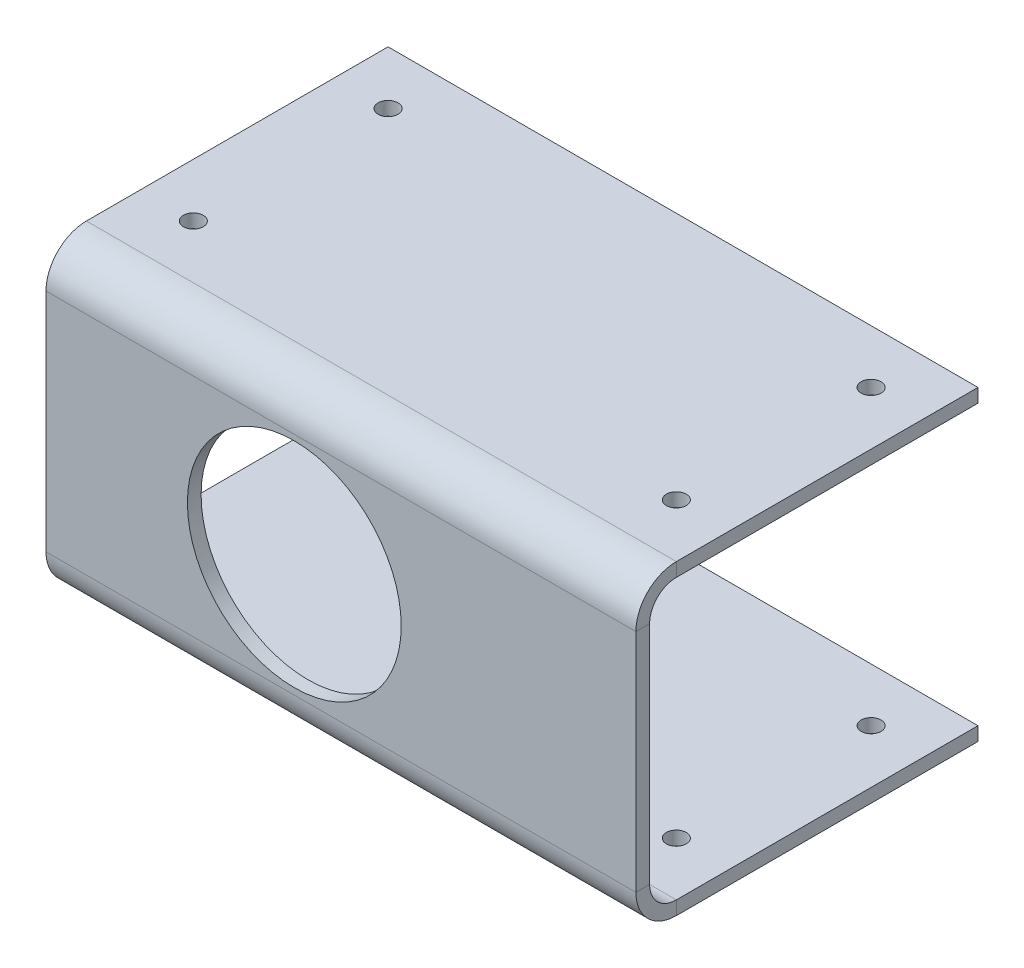
ISO-10303-21;
HEADER;
FILE_DESCRIPTION(('STEP AP214'),'2;1');
FILE_NAME('part.step','',(''),(''),'','','');
FILE_SCHEMA(('AUTOMOTIVE_DESIGN { 1 0 10303 214 1 1 1 1 }'));
ENDSEC;
DATA;
#1=APPLICATION_CONTEXT('core data for automotive mechanical design processes');
#2=APPLICATION_PROTOCOL_DEFINITION('international standard','automotive_design',2000,#1);
#3=PRODUCT_CONTEXT('',#1,'mechanical');
#4=PRODUCT('Part','Part','',(#3));
#5=PRODUCT_RELATED_PRODUCT_CATEGORY('part','',(#4));
#6=PRODUCT_DEFINITION_FORMATION('','',#4);
#7=PRODUCT_DEFINITION_CONTEXT('part definition',#1,'design');
#8=PRODUCT_DEFINITION('design','',#6,#7);
#9=PRODUCT_DEFINITION_SHAPE('','',#8);
#10=(LENGTH_UNIT() NAMED_UNIT(*) SI_UNIT(.MILLI.,.METRE.));
#11=(NAMED_UNIT(*) PLANE_ANGLE_UNIT() SI_UNIT($,.RADIAN.));
#12=(NAMED_UNIT(*) SI_UNIT($,.STERADIAN.) SOLID_ANGLE_UNIT());
#13=UNCERTAINTY_MEASURE_WITH_UNIT(LENGTH_MEASURE(1.E-05),#10,'distance_accuracy_value','');
#14=(GEOMETRIC_REPRESENTATION_CONTEXT(3) GLOBAL_UNCERTAINTY_ASSIGNED_CONTEXT((#13)) GLOBAL_UNIT_ASSIGNED_CONTEXT((#10,
#11,#12)) REPRESENTATION_CONTEXT('',''));
#15=CARTESIAN_POINT('',(0.,0.,0.));
#16=DIRECTION('',(0.,0.,1.));
#17=DIRECTION('',(1.,0.,0.));
#18=AXIS2_PLACEMENT_3D('',#15,#16,#17);
#19=CARTESIAN_POINT('',(-12.6221458224966,8.32,0.8128));
#20=DIRECTION('',(1.,0.,0.));
#21=DIRECTION('',(0.,1.,0.));
#22=AXIS2_PLACEMENT_3D('',#19,#20,#21);
#23=PLANE('',#22);
#24=DIRECTION('',(0.,0.,1.));
#25=VECTOR('',#24,1.);
#26=CARTESIAN_POINT('',(-12.6221458224966,6.7325,0.));
#27=LINE('',#26,#25);
#28=CARTESIAN_POINT('',(-12.6221458224966,6.7325,0.));
#29=VERTEX_POINT('',#28);
#30=CARTESIAN_POINT('',(-12.6221458224966,6.7325,0.8128));
#31=VERTEX_POINT('',#30);
#32=EDGE_CURVE('E183',#29,#31,#27,.T.);
#33=ORIENTED_EDGE('',*,*,#32,.F.);
#34=DIRECTION('',(0.,-1.,0.));
#35=VECTOR('',#34,1.);
#36=CARTESIAN_POINT('',(-12.6221458224966,8.32,0.));
#37=LINE('',#36,#35);
#38=CARTESIAN_POINT('',(-12.6221458224966,-6.68250000000001,0.));
#39=VERTEX_POINT('',#38);
#40=EDGE_CURVE('E234',#29,#39,#37,.T.);
#41=ORIENTED_EDGE('',*,*,#40,.T.);
#42=DIRECTION('',(0.,0.,1.));
#43=VECTOR('',#42,1.);
#44=CARTESIAN_POINT('',(-12.6221458224966,-6.68250000000001,0.));
#45=LINE('',#44,#43);
#46=CARTESIAN_POINT('',(-12.6221458224966,-6.68250000000001,0.8128));
#47=VERTEX_POINT('',#46);
#48=EDGE_CURVE('E222',#39,#47,#45,.T.);
#49=ORIENTED_EDGE('',*,*,#48,.T.);
#50=DIRECTION('',(0.,-1.,0.));
#51=VECTOR('',#50,1.);
#52=CARTESIAN_POINT('',(-12.6221458224966,8.32,0.8128));
#53=LINE('',#52,#51);
#54=EDGE_CURVE('E44',#31,#47,#53,.T.);
#55=ORIENTED_EDGE('',*,*,#54,.F.);
#56=EDGE_LOOP('',(#33,#41,#49,#55));
#57=FACE_BOUND('',#56,.T.);
#58=ADVANCED_FACE('F36',(#57),#23,.F.);
#59=CARTESIAN_POINT('',(22.42,-8.27,0.8128));
#60=DIRECTION('',(-1.,0.,0.));
#61=DIRECTION('',(0.,0.,1.));
#62=AXIS2_PLACEMENT_3D('',#59,#60,#61);
#63=PLANE('',#62);
#64=DIRECTION('',(0.,0.,1.));
#65=VECTOR('',#64,1.);
#66=CARTESIAN_POINT('',(22.42,6.7325,0.));
#67=LINE('',#66,#65);
#68=CARTESIAN_POINT('',(22.42,6.7325,0.));
#69=VERTEX_POINT('',#68);
#70=CARTESIAN_POINT('',(22.42,6.7325,0.812800000000002));
#71=VERTEX_POINT('',#70);
#72=EDGE_CURVE('E176',#69,#71,#67,.T.);
#73=ORIENTED_EDGE('',*,*,#72,.T.);
#74=DIRECTION('',(0.,1.,0.));
#75=VECTOR('',#74,1.);
#76=CARTESIAN_POINT('',(22.42,-8.27,0.8128));
#77=LINE('',#76,#75);
#78=CARTESIAN_POINT('',(22.42,-6.68250000000001,0.8128));
#79=VERTEX_POINT('',#78);
#80=EDGE_CURVE('E11',#79,#71,#77,.T.);
#81=ORIENTED_EDGE('',*,*,#80,.F.);
#82=DIRECTION('',(0.,0.,1.));
#83=VECTOR('',#82,1.);
#84=CARTESIAN_POINT('',(22.42,-6.68250000000001,0.));
#85=LINE('',#84,#83);
#86=CARTESIAN_POINT('',(22.42,-6.68250000000001,0.));
#87=VERTEX_POINT('',#86);
#88=EDGE_CURVE('E232',#87,#79,#85,.T.);
#89=ORIENTED_EDGE('',*,*,#88,.F.);
#90=DIRECTION('',(0.,1.,0.));
#91=VECTOR('',#90,1.);
#92=CARTESIAN_POINT('',(22.42,-8.27,0.));
#93=LINE('',#92,#91);
#94=EDGE_CURVE('E238',#87,#69,#93,.T.);
#95=ORIENTED_EDGE('',*,*,#94,.T.);
#96=EDGE_LOOP('',(#73,#81,#89,#95));
#97=FACE_BOUND('',#96,.T.);
#98=ADVANCED_FACE('F325',(#97),#63,.F.);
#99=CARTESIAN_POINT('',(0.,0.,0.8128));
#100=DIRECTION('',(0.,0.,1.));
#101=DIRECTION('',(1.,0.,0.));
#102=AXIS2_PLACEMENT_3D('',#99,#100,#101);
#103=PLANE('',#102);
#104=CARTESIAN_POINT('',(2.12785417750338,0.0499999999999398,0.8128));
#105=DIRECTION('',(0.,0.,1.));
#106=DIRECTION('',(1.,0.,0.));
#107=AXIS2_PLACEMENT_3D('',#104,#105,#106);
#108=CIRCLE('',#107,6.35);
#109=CARTESIAN_POINT('',(8.47785417750338,0.0499999999999398,0.8128));
#110=VERTEX_POINT('',#109);
#111=EDGE_CURVE('E248',#110,#110,#108,.T.);
#112=ORIENTED_EDGE('',*,*,#111,.F.);
#113=EDGE_LOOP('',(#112));
#114=FACE_BOUND('',#113,.T.);
#115=ORIENTED_EDGE('',*,*,#80,.T.);
#116=DIRECTION('',(1.,0.,0.));
#117=VECTOR('',#116,1.);
#118=CARTESIAN_POINT('',(22.42,6.7325,0.812800000000002));
#119=LINE('',#118,#117);
#120=EDGE_CURVE('E130',#71,#31,#119,.F.);
#121=ORIENTED_EDGE('',*,*,#120,.T.);
#122=ORIENTED_EDGE('',*,*,#54,.T.);
#123=DIRECTION('',(-1.,0.,0.));
#124=VECTOR('',#123,1.);
#125=CARTESIAN_POINT('',(-12.6221458224966,-6.68250000000001,0.8128));
#126=LINE('',#125,#124);
#127=EDGE_CURVE('E217',#47,#79,#126,.F.);
#128=ORIENTED_EDGE('',*,*,#127,.T.);
#129=EDGE_LOOP('',(#115,#121,#122,#128));
#130=FACE_BOUND('',#129,.T.);
#131=ADVANCED_FACE('F330',(#114,#130),#103,.T.);
#132=CARTESIAN_POINT('',(0.,0.,0.));
#133=DIRECTION('',(0.,0.,1.));
#134=DIRECTION('',(1.,0.,0.));
#135=AXIS2_PLACEMENT_3D('',#132,#133,#134);
#136=PLANE('',#135);
#137=CARTESIAN_POINT('',(2.12785417750338,0.0499999999999398,0.));
#138=DIRECTION('',(0.,0.,1.));
#139=DIRECTION('',(1.,0.,0.));
#140=AXIS2_PLACEMENT_3D('',#137,#138,#139);
#141=CIRCLE('',#140,6.35);
#142=CARTESIAN_POINT('',(8.47785417750338,0.0499999999999398,0.));
#143=VERTEX_POINT('',#142);
#144=EDGE_CURVE('E244',#143,#143,#141,.T.);
#145=ORIENTED_EDGE('',*,*,#144,.T.);
#146=EDGE_LOOP('',(#145));
#147=FACE_BOUND('',#146,.T.);
#148=DIRECTION('',(1.,0.,0.));
#149=VECTOR('',#148,1.);
#150=CARTESIAN_POINT('',(22.42,6.7325,0.));
#151=LINE('',#150,#149);
#152=EDGE_CURVE('E180',#69,#29,#151,.F.);
#153=ORIENTED_EDGE('',*,*,#152,.F.);
#154=ORIENTED_EDGE('',*,*,#94,.F.);
#155=DIRECTION('',(-1.,0.,0.));
#156=VECTOR('',#155,1.);
#157=CARTESIAN_POINT('',(-12.6221458224966,-6.68250000000001,0.));
#158=LINE('',#157,#156);
#159=EDGE_CURVE('E228',#39,#87,#158,.F.);
#160=ORIENTED_EDGE('',*,*,#159,.F.);
#161=ORIENTED_EDGE('',*,*,#40,.F.);
#162=EDGE_LOOP('',(#153,#154,#160,#161));
#163=FACE_BOUND('',#162,.T.);
#164=ADVANCED_FACE('F340',(#147,#163),#136,.F.);
#165=CARTESIAN_POINT('',(22.42,-6.68250000000001,-1.5875));
#166=DIRECTION('',(1.,0.,0.));
#167=DIRECTION('',(0.,0.,-1.));
#168=AXIS2_PLACEMENT_3D('',#165,#166,#167);
#169=PLANE('',#168);
#170=DIRECTION('',(0.,-1.,0.));
#171=VECTOR('',#170,1.);
#172=CARTESIAN_POINT('',(22.42,-8.27000000000001,-1.58749999999999));
#173=LINE('',#172,#171);
#174=CARTESIAN_POINT('',(22.42,-8.27,-1.58749999999999));
#175=VERTEX_POINT('',#174);
#176=CARTESIAN_POINT('',(22.42,-9.08280000000001,-1.58749999999999));
#177=VERTEX_POINT('',#176);
#178=EDGE_CURVE('E185',#175,#177,#173,.T.);
#179=ORIENTED_EDGE('',*,*,#178,.F.);
#180=CARTESIAN_POINT('',(22.42,-6.68250000000001,-1.5875));
#181=DIRECTION('',(-1.,0.,0.));
#182=DIRECTION('',(0.,0.,1.));
#183=AXIS2_PLACEMENT_3D('',#180,#181,#182);
#184=CIRCLE('',#183,1.5875);
#185=EDGE_CURVE('E225',#87,#175,#184,.F.);
#186=ORIENTED_EDGE('',*,*,#185,.F.);
#187=ORIENTED_EDGE('',*,*,#88,.T.);
#188=CARTESIAN_POINT('',(22.42,-6.68250000000001,-1.5875));
#189=DIRECTION('',(-1.,0.,0.));
#190=DIRECTION('',(0.,0.,1.));
#191=AXIS2_PLACEMENT_3D('',#188,#189,#190);
#192=CIRCLE('',#191,2.4003);
#193=EDGE_CURVE('E60',#79,#177,#192,.F.);
#194=ORIENTED_EDGE('',*,*,#193,.T.);
#195=EDGE_LOOP('',(#179,#186,#187,#194));
#196=FACE_BOUND('',#195,.T.);
#197=ADVANCED_FACE('F347',(#196),#169,.T.);
#198=CARTESIAN_POINT('',(-12.6221458224966,-6.68250000000001,-1.5875));
#199=DIRECTION('',(1.,0.,0.));
#200=DIRECTION('',(0.,0.,-1.));
#201=AXIS2_PLACEMENT_3D('',#198,#199,#200);
#202=PLANE('',#201);
#203=CARTESIAN_POINT('',(-12.6221458224966,-6.68250000000001,-1.5875));
#204=DIRECTION('',(-1.,0.,0.));
#205=DIRECTION('',(0.,0.,1.));
#206=AXIS2_PLACEMENT_3D('',#203,#204,#205);
#207=CIRCLE('',#206,1.5875);
#208=CARTESIAN_POINT('',(-12.6221458224966,-8.27,-1.58749999999999));
#209=VERTEX_POINT('',#208);
#210=EDGE_CURVE('E216',#209,#39,#207,.T.);
#211=ORIENTED_EDGE('',*,*,#210,.F.);
#212=DIRECTION('',(0.,-1.,0.));
#213=VECTOR('',#212,1.);
#214=CARTESIAN_POINT('',(-12.6221458224966,-8.27000000000001,-1.58749999999999));
#215=LINE('',#214,#213);
#216=CARTESIAN_POINT('',(-12.6221458224966,-9.08280000000001,-1.58749999999999));
#217=VERTEX_POINT('',#216);
#218=EDGE_CURVE('E189',#209,#217,#215,.T.);
#219=ORIENTED_EDGE('',*,*,#218,.T.);
#220=CARTESIAN_POINT('',(-12.6221458224966,-6.68250000000001,-1.5875));
#221=DIRECTION('',(-1.,0.,0.));
#222=DIRECTION('',(0.,0.,1.));
#223=AXIS2_PLACEMENT_3D('',#220,#221,#222);
#224=CIRCLE('',#223,2.4003);
#225=EDGE_CURVE('E220',#217,#47,#224,.T.);
#226=ORIENTED_EDGE('',*,*,#225,.T.);
#227=ORIENTED_EDGE('',*,*,#48,.F.);
#228=EDGE_LOOP('',(#211,#219,#226,#227));
#229=FACE_BOUND('',#228,.T.);
#230=ADVANCED_FACE('F367',(#229),#202,.F.);
#231=CARTESIAN_POINT('',(-12.6221458224966,-6.68250000000001,-1.5875));
#232=DIRECTION('',(-1.,0.,0.));
#233=DIRECTION('',(0.,-1.,0.));
#234=AXIS2_PLACEMENT_3D('',#231,#232,#233);
#235=CYLINDRICAL_SURFACE('',#234,2.4003);
#236=ORIENTED_EDGE('',*,*,#127,.F.);
#237=ORIENTED_EDGE('',*,*,#225,.F.);
#238=DIRECTION('',(1.,0.,0.));
#239=VECTOR('',#238,1.);
#240=CARTESIAN_POINT('',(0.,-9.08280000000001,-1.58749999999999));
#241=LINE('',#240,#239);
#242=EDGE_CURVE('E192',#217,#177,#241,.T.);
#243=ORIENTED_EDGE('',*,*,#242,.T.);
#244=ORIENTED_EDGE('',*,*,#193,.F.);
#245=EDGE_LOOP('',(#236,#237,#243,#244));
#246=FACE_BOUND('',#245,.T.);
#247=ADVANCED_FACE('F377',(#246),#235,.T.);
#248=CARTESIAN_POINT('',(-12.6221458224966,-6.68250000000001,-1.5875));
#249=DIRECTION('',(-1.,0.,0.));
#250=DIRECTION('',(0.,-1.,0.));
#251=AXIS2_PLACEMENT_3D('',#248,#249,#250);
#252=CYLINDRICAL_SURFACE('',#251,1.5875);
#253=ORIENTED_EDGE('',*,*,#159,.T.);
#254=ORIENTED_EDGE('',*,*,#185,.T.);
#255=DIRECTION('',(-1.,0.,0.));
#256=VECTOR('',#255,1.);
#257=CARTESIAN_POINT('',(22.42,-8.27000000000001,-1.58749999999999));
#258=LINE('',#257,#256);
#259=EDGE_CURVE('E187',#175,#209,#258,.T.);
#260=ORIENTED_EDGE('',*,*,#259,.T.);
#261=ORIENTED_EDGE('',*,*,#210,.T.);
#262=EDGE_LOOP('',(#253,#254,#260,#261));
#263=FACE_BOUND('',#262,.T.);
#264=ADVANCED_FACE('F343',(#263),#252,.F.);
#265=CARTESIAN_POINT('',(-12.6221458224966,-9.08280000000007,-19.5072));
#266=DIRECTION('',(1.,0.,0.));
#267=DIRECTION('',(0.,0.,-1.));
#268=AXIS2_PLACEMENT_3D('',#265,#266,#267);
#269=PLANE('',#268);
#270=ORIENTED_EDGE('',*,*,#218,.F.);
#271=DIRECTION('',(0.,0.,-1.));
#272=VECTOR('',#271,1.);
#273=CARTESIAN_POINT('',(-12.6221458224966,-8.27000000000007,-19.5072));
#274=LINE('',#273,#272);
#275=CARTESIAN_POINT('',(-12.6221458224966,-8.27000000000007,-19.5072));
#276=VERTEX_POINT('',#275);
#277=EDGE_CURVE('E196',#209,#276,#274,.T.);
#278=ORIENTED_EDGE('',*,*,#277,.T.);
#279=DIRECTION('',(0.,1.,0.));
#280=VECTOR('',#279,1.);
#281=CARTESIAN_POINT('',(-12.6221458224966,-9.08280000000007,-19.5072));
#282=LINE('',#281,#280);
#283=CARTESIAN_POINT('',(-12.6221458224966,-9.08280000000007,-19.5072));
#284=VERTEX_POINT('',#283);
#285=EDGE_CURVE('E213',#284,#276,#282,.T.);
#286=ORIENTED_EDGE('',*,*,#285,.F.);
#287=DIRECTION('',(0.,0.,-1.));
#288=VECTOR('',#287,1.);
#289=CARTESIAN_POINT('',(-12.6221458224966,-9.08280000000007,-19.5072));
#290=LINE('',#289,#288);
#291=EDGE_CURVE('E197',#217,#284,#290,.T.);
#292=ORIENTED_EDGE('',*,*,#291,.F.);
#293=EDGE_LOOP('',(#270,#278,#286,#292));
#294=FACE_BOUND('',#293,.T.);
#295=ADVANCED_FACE('F369',(#294),#269,.F.);
#296=CARTESIAN_POINT('',(22.42,-9.0828,0.));
#297=DIRECTION('',(-1.,0.,0.));
#298=DIRECTION('',(0.,0.,1.));
#299=AXIS2_PLACEMENT_3D('',#296,#297,#298);
#300=PLANE('',#299);
#301=ORIENTED_EDGE('',*,*,#178,.T.);
#302=DIRECTION('',(0.,0.,1.));
#303=VECTOR('',#302,1.);
#304=CARTESIAN_POINT('',(22.42,-9.0828,0.));
#305=LINE('',#304,#303);
#306=CARTESIAN_POINT('',(22.42,-9.08280000000007,-19.5072));
#307=VERTEX_POINT('',#306);
#308=EDGE_CURVE('E202',#307,#177,#305,.T.);
#309=ORIENTED_EDGE('',*,*,#308,.F.);
#310=DIRECTION('',(0.,1.,0.));
#311=VECTOR('',#310,1.);
#312=CARTESIAN_POINT('',(22.42,-9.08280000000007,-19.5072));
#313=LINE('',#312,#311);
#314=CARTESIAN_POINT('',(22.42,-8.27000000000007,-19.5072));
#315=VERTEX_POINT('',#314);
#316=EDGE_CURVE('E205',#307,#315,#313,.T.);
#317=ORIENTED_EDGE('',*,*,#316,.T.);
#318=DIRECTION('',(0.,0.,1.));
#319=VECTOR('',#318,1.);
#320=CARTESIAN_POINT('',(22.42,-8.27,0.));
#321=LINE('',#320,#319);
#322=EDGE_CURVE('E200',#315,#175,#321,.T.);
#323=ORIENTED_EDGE('',*,*,#322,.T.);
#324=EDGE_LOOP('',(#301,#309,#317,#323));
#325=FACE_BOUND('',#324,.T.);
#326=ADVANCED_FACE('F350',(#325),#300,.F.);
#327=CARTESIAN_POINT('',(0.,-9.0828,0.));
#328=DIRECTION('',(0.,1.,0.));
#329=DIRECTION('',(0.,0.,1.));
#330=AXIS2_PLACEMENT_3D('',#327,#328,#329);
#331=PLANE('',#330);
#332=CARTESIAN_POINT('',(19.245,-9.08280000000012,-4.7625000000003));
#333=DIRECTION('',(0.,1.,0.));
#334=DIRECTION('',(0.,0.,1.));
#335=AXIS2_PLACEMENT_3D('',#332,#333,#334);
#336=CIRCLE('',#335,0.590549999999999);
#337=CARTESIAN_POINT('',(19.245,-9.08280000000012,-4.1719500000003));
#338=VERTEX_POINT('',#337);
#339=EDGE_CURVE('E658',#338,#338,#336,.T.);
#340=ORIENTED_EDGE('',*,*,#339,.T.);
#341=EDGE_LOOP('',(#340));
#342=FACE_BOUND('',#341,.T.);
#343=CARTESIAN_POINT('',(19.245,-9.08280000000008,-16.3322000000002));
#344=DIRECTION('',(0.,1.,0.));
#345=DIRECTION('',(0.,0.,1.));
#346=AXIS2_PLACEMENT_3D('',#343,#344,#345);
#347=CIRCLE('',#346,0.590549999999999);
#348=CARTESIAN_POINT('',(19.245,-9.08280000000008,-15.7416500000002));
#349=VERTEX_POINT('',#348);
#350=EDGE_CURVE('E256',#349,#349,#347,.T.);
#351=ORIENTED_EDGE('',*,*,#350,.T.);
#352=EDGE_LOOP('',(#351));
#353=FACE_BOUND('',#352,.T.);
#354=CARTESIAN_POINT('',(-9.44714582249659,-9.08280000000008,-16.3322000000002));
#355=DIRECTION('',(0.,1.,0.));
#356=DIRECTION('',(0.,0.,1.));
#357=AXIS2_PLACEMENT_3D('',#354,#355,#356);
#358=CIRCLE('',#357,0.590549999999997);
#359=CARTESIAN_POINT('',(-9.44714582249659,-9.08280000000008,-15.7416500000002));
#360=VERTEX_POINT('',#359);
#361=EDGE_CURVE('E252',#360,#360,#358,.T.);
#362=ORIENTED_EDGE('',*,*,#361,.T.);
#363=EDGE_LOOP('',(#362));
#364=FACE_BOUND('',#363,.T.);
#365=CARTESIAN_POINT('',(-9.44714582249658,-9.08280000000012,-4.7625000000003));
#366=DIRECTION('',(0.,1.,0.));
#367=DIRECTION('',(0.,0.,1.));
#368=AXIS2_PLACEMENT_3D('',#365,#366,#367);
#369=CIRCLE('',#368,0.590549999999997);
#370=CARTESIAN_POINT('',(-9.44714582249658,-9.08280000000012,-4.1719500000003));
#371=VERTEX_POINT('',#370);
#372=EDGE_CURVE('E281',#371,#371,#369,.T.);
#373=ORIENTED_EDGE('',*,*,#372,.T.);
#374=EDGE_LOOP('',(#373));
#375=FACE_BOUND('',#374,.T.);
#376=ORIENTED_EDGE('',*,*,#242,.F.);
#377=ORIENTED_EDGE('',*,*,#291,.T.);
#378=DIRECTION('',(1.,0.,0.));
#379=VECTOR('',#378,1.);
#380=CARTESIAN_POINT('',(22.42,-9.08280000000007,-19.5072));
#381=LINE('',#380,#379);
#382=EDGE_CURVE('E199',#284,#307,#381,.T.);
#383=ORIENTED_EDGE('',*,*,#382,.T.);
#384=ORIENTED_EDGE('',*,*,#308,.T.);
#385=EDGE_LOOP('',(#376,#377,#383,#384));
#386=FACE_BOUND('',#385,.T.);
#387=ADVANCED_FACE('F354',(#342,#353,#364,#375,#386),#331,.F.);
#388=CARTESIAN_POINT('',(0.,-8.27,0.));
#389=DIRECTION('',(0.,1.,0.));
#390=DIRECTION('',(0.,0.,1.));
#391=AXIS2_PLACEMENT_3D('',#388,#389,#390);
#392=PLANE('',#391);
#393=CARTESIAN_POINT('',(19.245,-8.27000000000002,-4.76250000000029));
#394=DIRECTION('',(0.,1.,0.));
#395=DIRECTION('',(0.,0.,1.));
#396=AXIS2_PLACEMENT_3D('',#393,#394,#395);
#397=CIRCLE('',#396,0.590549999999993);
#398=CARTESIAN_POINT('',(19.245,-8.27000000000002,-4.1719500000003));
#399=VERTEX_POINT('',#398);
#400=EDGE_CURVE('E268',#399,#399,#397,.T.);
#401=ORIENTED_EDGE('',*,*,#400,.F.);
#402=EDGE_LOOP('',(#401));
#403=FACE_BOUND('',#402,.T.);
#404=CARTESIAN_POINT('',(19.245,-8.27000000000006,-16.3322000000002));
#405=DIRECTION('',(0.,1.,0.));
#406=DIRECTION('',(0.,0.,1.));
#407=AXIS2_PLACEMENT_3D('',#404,#405,#406);
#408=CIRCLE('',#407,0.590549999999993);
#409=CARTESIAN_POINT('',(19.245,-8.27000000000005,-15.7416500000002));
#410=VERTEX_POINT('',#409);
#411=EDGE_CURVE('E255',#410,#410,#408,.T.);
#412=ORIENTED_EDGE('',*,*,#411,.F.);
#413=EDGE_LOOP('',(#412));
#414=FACE_BOUND('',#413,.T.);
#415=CARTESIAN_POINT('',(-9.44714582249659,-8.27000000000005,-16.3322000000002));
#416=DIRECTION('',(0.,1.,0.));
#417=DIRECTION('',(0.,0.,1.));
#418=AXIS2_PLACEMENT_3D('',#415,#416,#417);
#419=CIRCLE('',#418,0.590549999999993);
#420=CARTESIAN_POINT('',(-9.44714582249659,-8.27000000000005,-15.7416500000002));
#421=VERTEX_POINT('',#420);
#422=EDGE_CURVE('E251',#421,#421,#419,.T.);
#423=ORIENTED_EDGE('',*,*,#422,.F.);
#424=EDGE_LOOP('',(#423));
#425=FACE_BOUND('',#424,.T.);
#426=CARTESIAN_POINT('',(-9.44714582249658,-8.27000000000002,-4.7625000000003));
#427=DIRECTION('',(0.,1.,0.));
#428=DIRECTION('',(0.,0.,1.));
#429=AXIS2_PLACEMENT_3D('',#426,#427,#428);
#430=CIRCLE('',#429,0.590549999999993);
#431=CARTESIAN_POINT('',(-9.44714582249658,-8.27000000000002,-4.1719500000003));
#432=VERTEX_POINT('',#431);
#433=EDGE_CURVE('E287',#432,#432,#430,.T.);
#434=ORIENTED_EDGE('',*,*,#433,.F.);
#435=EDGE_LOOP('',(#434));
#436=FACE_BOUND('',#435,.T.);
#437=ORIENTED_EDGE('',*,*,#277,.F.);
#438=ORIENTED_EDGE('',*,*,#259,.F.);
#439=ORIENTED_EDGE('',*,*,#322,.F.);
#440=DIRECTION('',(1.,0.,0.));
#441=VECTOR('',#440,1.);
#442=CARTESIAN_POINT('',(22.42,-8.27000000000007,-19.5072));
#443=LINE('',#442,#441);
#444=EDGE_CURVE('E207',#276,#315,#443,.T.);
#445=ORIENTED_EDGE('',*,*,#444,.F.);
#446=EDGE_LOOP('',(#437,#438,#439,#445));
#447=FACE_BOUND('',#446,.T.);
#448=ADVANCED_FACE('F364',(#403,#414,#425,#436,#447),#392,.T.);
#449=CARTESIAN_POINT('',(22.42,-9.08280000000007,-19.5072));
#450=DIRECTION('',(0.,0.,1.));
#451=DIRECTION('',(0.,-1.,0.));
#452=AXIS2_PLACEMENT_3D('',#449,#450,#451);
#453=PLANE('',#452);
#454=ORIENTED_EDGE('',*,*,#444,.T.);
#455=ORIENTED_EDGE('',*,*,#316,.F.);
#456=ORIENTED_EDGE('',*,*,#382,.F.);
#457=ORIENTED_EDGE('',*,*,#285,.T.);
#458=EDGE_LOOP('',(#454,#455,#456,#457));
#459=FACE_BOUND('',#458,.T.);
#460=ADVANCED_FACE('F360',(#459),#453,.F.);
#461=CARTESIAN_POINT('',(-12.6221458224966,6.7325,-1.5875));
#462=DIRECTION('',(-1.,0.,0.));
#463=DIRECTION('',(0.,0.,1.));
#464=AXIS2_PLACEMENT_3D('',#461,#462,#463);
#465=PLANE('',#464);
#466=DIRECTION('',(0.,1.,0.));
#467=VECTOR('',#466,1.);
#468=CARTESIAN_POINT('',(-12.6221458224966,8.32,-1.5875));
#469=LINE('',#468,#467);
#470=CARTESIAN_POINT('',(-12.6221458224966,8.32,-1.5875));
#471=VERTEX_POINT('',#470);
#472=CARTESIAN_POINT('',(-12.6221458224966,9.1328,-1.58749999999999));
#473=VERTEX_POINT('',#472);
#474=EDGE_CURVE('E247',#471,#473,#469,.T.);
#475=ORIENTED_EDGE('',*,*,#474,.F.);
#476=CARTESIAN_POINT('',(-12.6221458224966,6.7325,-1.5875));
#477=DIRECTION('',(1.,0.,0.));
#478=DIRECTION('',(0.,0.,-1.));
#479=AXIS2_PLACEMENT_3D('',#476,#477,#478);
#480=CIRCLE('',#479,1.5875);
#481=EDGE_CURVE('E133',#29,#471,#480,.F.);
#482=ORIENTED_EDGE('',*,*,#481,.F.);
#483=ORIENTED_EDGE('',*,*,#32,.T.);
#484=CARTESIAN_POINT('',(-12.6221458224966,6.7325,-1.5875));
#485=DIRECTION('',(1.,0.,0.));
#486=DIRECTION('',(0.,0.,-1.));
#487=AXIS2_PLACEMENT_3D('',#484,#485,#486);
#488=CIRCLE('',#487,2.4003);
#489=EDGE_CURVE('E52',#31,#473,#488,.F.);
#490=ORIENTED_EDGE('',*,*,#489,.T.);
#491=EDGE_LOOP('',(#475,#482,#483,#490));
#492=FACE_BOUND('',#491,.T.);
#493=ADVANCED_FACE('F298',(#492),#465,.T.);
#494=CARTESIAN_POINT('',(22.42,6.7325,-1.5875));
#495=DIRECTION('',(-1.,0.,0.));
#496=DIRECTION('',(0.,0.,1.));
#497=AXIS2_PLACEMENT_3D('',#494,#495,#496);
#498=PLANE('',#497);
#499=CARTESIAN_POINT('',(22.42,6.7325,-1.5875));
#500=DIRECTION('',(1.,0.,0.));
#501=DIRECTION('',(0.,0.,-1.));
#502=AXIS2_PLACEMENT_3D('',#499,#500,#501);
#503=CIRCLE('',#502,1.5875);
#504=CARTESIAN_POINT('',(22.42,8.32,-1.58749999999999));
#505=VERTEX_POINT('',#504);
#506=EDGE_CURVE('E140',#505,#69,#503,.T.);
#507=ORIENTED_EDGE('',*,*,#506,.F.);
#508=DIRECTION('',(0.,1.,0.));
#509=VECTOR('',#508,1.);
#510=CARTESIAN_POINT('',(22.42,8.32,-1.58749999999999));
#511=LINE('',#510,#509);
#512=CARTESIAN_POINT('',(22.42,9.1328,-1.58749999999999));
#513=VERTEX_POINT('',#512);
#514=EDGE_CURVE('E137',#505,#513,#511,.T.);
#515=ORIENTED_EDGE('',*,*,#514,.T.);
#516=CARTESIAN_POINT('',(22.42,6.7325,-1.5875));
#517=DIRECTION('',(1.,0.,0.));
#518=DIRECTION('',(0.,0.,-1.));
#519=AXIS2_PLACEMENT_3D('',#516,#517,#518);
#520=CIRCLE('',#519,2.4003);
#521=EDGE_CURVE('E124',#513,#71,#520,.T.);
#522=ORIENTED_EDGE('',*,*,#521,.T.);
#523=ORIENTED_EDGE('',*,*,#72,.F.);
#524=EDGE_LOOP('',(#507,#515,#522,#523));
#525=FACE_BOUND('',#524,.T.);
#526=ADVANCED_FACE('F138',(#525),#498,.F.);
#527=CARTESIAN_POINT('',(22.42,6.7325,-1.5875));
#528=DIRECTION('',(1.,0.,0.));
#529=DIRECTION('',(0.,1.,0.));
#530=AXIS2_PLACEMENT_3D('',#527,#528,#529);
#531=CYLINDRICAL_SURFACE('',#530,2.4003);
#532=ORIENTED_EDGE('',*,*,#120,.F.);
#533=ORIENTED_EDGE('',*,*,#521,.F.);
#534=DIRECTION('',(-1.,0.,0.));
#535=VECTOR('',#534,1.);
#536=CARTESIAN_POINT('',(0.,9.1328,-1.58749999999999));
#537=LINE('',#536,#535);
#538=EDGE_CURVE('E128',#513,#473,#537,.T.);
#539=ORIENTED_EDGE('',*,*,#538,.T.);
#540=ORIENTED_EDGE('',*,*,#489,.F.);
#541=EDGE_LOOP('',(#532,#533,#539,#540));
#542=FACE_BOUND('',#541,.T.);
#543=ADVANCED_FACE('F126',(#542),#531,.T.);
#544=CARTESIAN_POINT('',(22.42,6.7325,-1.5875));
#545=DIRECTION('',(1.,0.,0.));
#546=DIRECTION('',(0.,1.,0.));
#547=AXIS2_PLACEMENT_3D('',#544,#545,#546);
#548=CYLINDRICAL_SURFACE('',#547,1.5875);
#549=ORIENTED_EDGE('',*,*,#152,.T.);
#550=ORIENTED_EDGE('',*,*,#481,.T.);
#551=DIRECTION('',(1.,0.,0.));
#552=VECTOR('',#551,1.);
#553=CARTESIAN_POINT('',(-12.6221458224966,8.32,-1.5875));
#554=LINE('',#553,#552);
#555=EDGE_CURVE('E144',#471,#505,#554,.T.);
#556=ORIENTED_EDGE('',*,*,#555,.T.);
#557=ORIENTED_EDGE('',*,*,#506,.T.);
#558=EDGE_LOOP('',(#549,#550,#556,#557));
#559=FACE_BOUND('',#558,.T.);
#560=ADVANCED_FACE('F302',(#559),#548,.F.);
#561=CARTESIAN_POINT('',(22.42,9.13280000000007,-19.5072));
#562=DIRECTION('',(-1.,0.,0.));
#563=DIRECTION('',(0.,0.,1.));
#564=AXIS2_PLACEMENT_3D('',#561,#562,#563);
#565=PLANE('',#564);
#566=ORIENTED_EDGE('',*,*,#514,.F.);
#567=DIRECTION('',(0.,0.,-1.));
#568=VECTOR('',#567,1.);
#569=CARTESIAN_POINT('',(22.42,8.32000000000007,-19.5072));
#570=LINE('',#569,#568);
#571=CARTESIAN_POINT('',(22.42,8.32000000000007,-19.5072));
#572=VERTEX_POINT('',#571);
#573=EDGE_CURVE('E153',#505,#572,#570,.T.);
#574=ORIENTED_EDGE('',*,*,#573,.T.);
#575=DIRECTION('',(0.,-1.,0.));
#576=VECTOR('',#575,1.);
#577=CARTESIAN_POINT('',(22.42,9.13280000000007,-19.5072));
#578=LINE('',#577,#576);
#579=CARTESIAN_POINT('',(22.42,9.13280000000007,-19.5072));
#580=VERTEX_POINT('',#579);
#581=EDGE_CURVE('E158',#580,#572,#578,.T.);
#582=ORIENTED_EDGE('',*,*,#581,.F.);
#583=DIRECTION('',(0.,0.,-1.));
#584=VECTOR('',#583,1.);
#585=CARTESIAN_POINT('',(22.42,9.13280000000007,-19.5072));
#586=LINE('',#585,#584);
#587=EDGE_CURVE('E149',#513,#580,#586,.T.);
#588=ORIENTED_EDGE('',*,*,#587,.F.);
#589=EDGE_LOOP('',(#566,#574,#582,#588));
#590=FACE_BOUND('',#589,.T.);
#591=ADVANCED_FACE('F156',(#590),#565,.F.);
#592=CARTESIAN_POINT('',(-12.6221458224966,9.1328,0.));
#593=DIRECTION('',(1.,0.,0.));
#594=DIRECTION('',(0.,1.,0.));
#595=AXIS2_PLACEMENT_3D('',#592,#593,#594);
#596=PLANE('',#595);
#597=ORIENTED_EDGE('',*,*,#474,.T.);
#598=DIRECTION('',(0.,0.,1.));
#599=VECTOR('',#598,1.);
#600=CARTESIAN_POINT('',(-12.6221458224966,9.1328,0.));
#601=LINE('',#600,#599);
#602=CARTESIAN_POINT('',(-12.6221458224966,9.13280000000007,-19.5072));
#603=VERTEX_POINT('',#602);
#604=EDGE_CURVE('E152',#603,#473,#601,.T.);
#605=ORIENTED_EDGE('',*,*,#604,.F.);
#606=DIRECTION('',(0.,-1.,0.));
#607=VECTOR('',#606,1.);
#608=CARTESIAN_POINT('',(-12.6221458224966,9.13280000000007,-19.5072));
#609=LINE('',#608,#607);
#610=CARTESIAN_POINT('',(-12.6221458224966,8.32000000000007,-19.5072));
#611=VERTEX_POINT('',#610);
#612=EDGE_CURVE('E169',#603,#611,#609,.T.);
#613=ORIENTED_EDGE('',*,*,#612,.T.);
#614=DIRECTION('',(0.,0.,1.));
#615=VECTOR('',#614,1.);
#616=CARTESIAN_POINT('',(-12.6221458224966,8.32,0.));
#617=LINE('',#616,#615);
#618=EDGE_CURVE('E160',#611,#471,#617,.T.);
#619=ORIENTED_EDGE('',*,*,#618,.T.);
#620=EDGE_LOOP('',(#597,#605,#613,#619));
#621=FACE_BOUND('',#620,.T.);
#622=ADVANCED_FACE('F294',(#621),#596,.F.);
#623=CARTESIAN_POINT('',(0.,9.1328,0.));
#624=DIRECTION('',(0.,-1.,0.));
#625=DIRECTION('',(0.,0.,-1.));
#626=AXIS2_PLACEMENT_3D('',#623,#624,#625);
#627=PLANE('',#626);
#628=CARTESIAN_POINT('',(19.245,9.13280000000002,-4.76250000000023));
#629=DIRECTION('',(0.,1.,0.));
#630=DIRECTION('',(0.,0.,1.));
#631=AXIS2_PLACEMENT_3D('',#628,#629,#630);
#632=CIRCLE('',#631,0.590549999999988);
#633=CARTESIAN_POINT('',(19.245,9.13280000000002,-4.17195000000024));
#634=VERTEX_POINT('',#633);
#635=EDGE_CURVE('E659',#634,#634,#632,.T.);
#636=ORIENTED_EDGE('',*,*,#635,.F.);
#637=EDGE_LOOP('',(#636));
#638=FACE_BOUND('',#637,.T.);
#639=CARTESIAN_POINT('',(19.245,9.13280000000006,-16.3322000000001));
#640=DIRECTION('',(0.,1.,0.));
#641=DIRECTION('',(0.,0.,1.));
#642=AXIS2_PLACEMENT_3D('',#639,#640,#641);
#643=CIRCLE('',#642,0.590549999999988);
#644=CARTESIAN_POINT('',(19.245,9.13280000000006,-15.7416500000002));
#645=VERTEX_POINT('',#644);
#646=EDGE_CURVE('E263',#645,#645,#643,.T.);
#647=ORIENTED_EDGE('',*,*,#646,.F.);
#648=EDGE_LOOP('',(#647));
#649=FACE_BOUND('',#648,.T.);
#650=CARTESIAN_POINT('',(-9.44714582249659,9.13280000000006,-16.3322000000001));
#651=DIRECTION('',(0.,1.,0.));
#652=DIRECTION('',(0.,0.,1.));
#653=AXIS2_PLACEMENT_3D('',#650,#651,#652);
#654=CIRCLE('',#653,0.590549999999988);
#655=CARTESIAN_POINT('',(-9.44714582249659,9.13280000000006,-15.7416500000002));
#656=VERTEX_POINT('',#655);
#657=EDGE_CURVE('E260',#656,#656,#654,.T.);
#658=ORIENTED_EDGE('',*,*,#657,.F.);
#659=EDGE_LOOP('',(#658));
#660=FACE_BOUND('',#659,.T.);
#661=CARTESIAN_POINT('',(-9.44714582249658,9.13280000000002,-4.76250000000023));
#662=DIRECTION('',(0.,1.,0.));
#663=DIRECTION('',(0.,0.,1.));
#664=AXIS2_PLACEMENT_3D('',#661,#662,#663);
#665=CIRCLE('',#664,0.590549999999988);
#666=CARTESIAN_POINT('',(-9.44714582249658,9.13280000000002,-4.17195000000025));
#667=VERTEX_POINT('',#666);
#668=EDGE_CURVE('E278',#667,#667,#665,.T.);
#669=ORIENTED_EDGE('',*,*,#668,.F.);
#670=EDGE_LOOP('',(#669));
#671=FACE_BOUND('',#670,.T.);
#672=ORIENTED_EDGE('',*,*,#538,.F.);
#673=ORIENTED_EDGE('',*,*,#587,.T.);
#674=DIRECTION('',(-1.,0.,0.));
#675=VECTOR('',#674,1.);
#676=CARTESIAN_POINT('',(-12.6221458224966,9.13280000000007,-19.5072));
#677=LINE('',#676,#675);
#678=EDGE_CURVE('E159',#580,#603,#677,.T.);
#679=ORIENTED_EDGE('',*,*,#678,.T.);
#680=ORIENTED_EDGE('',*,*,#604,.T.);
#681=EDGE_LOOP('',(#672,#673,#679,#680));
#682=FACE_BOUND('',#681,.T.);
#683=ADVANCED_FACE('F148',(#638,#649,#660,#671,#682),#627,.F.);
#684=CARTESIAN_POINT('',(0.,8.32,0.));
#685=DIRECTION('',(0.,-1.,0.));
#686=DIRECTION('',(0.,0.,-1.));
#687=AXIS2_PLACEMENT_3D('',#684,#685,#686);
#688=PLANE('',#687);
#689=CARTESIAN_POINT('',(19.245,8.32000000000001,-4.76250000000023));
#690=DIRECTION('',(0.,-1.,0.));
#691=DIRECTION('',(0.,0.,-1.));
#692=AXIS2_PLACEMENT_3D('',#689,#690,#691);
#693=CIRCLE('',#692,0.590549999999993);
#694=CARTESIAN_POINT('',(19.245,8.32000000000002,-5.35305000000023));
#695=VERTEX_POINT('',#694);
#696=EDGE_CURVE('E39',#695,#695,#693,.T.);
#697=ORIENTED_EDGE('',*,*,#696,.F.);
#698=EDGE_LOOP('',(#697));
#699=FACE_BOUND('',#698,.T.);
#700=CARTESIAN_POINT('',(19.245,8.32000000000006,-16.3322000000001));
#701=DIRECTION('',(0.,-1.,0.));
#702=DIRECTION('',(0.,0.,-1.));
#703=AXIS2_PLACEMENT_3D('',#700,#701,#702);
#704=CIRCLE('',#703,0.590549999999993);
#705=CARTESIAN_POINT('',(19.245,8.32000000000006,-16.9227500000001));
#706=VERTEX_POINT('',#705);
#707=EDGE_CURVE('E253',#706,#706,#704,.T.);
#708=ORIENTED_EDGE('',*,*,#707,.F.);
#709=EDGE_LOOP('',(#708));
#710=FACE_BOUND('',#709,.T.);
#711=CARTESIAN_POINT('',(-9.44714582249659,8.32000000000006,-16.3322000000001));
#712=DIRECTION('',(0.,-1.,0.));
#713=DIRECTION('',(0.,0.,-1.));
#714=AXIS2_PLACEMENT_3D('',#711,#712,#713);
#715=CIRCLE('',#714,0.590549999999993);
#716=CARTESIAN_POINT('',(-9.44714582249659,8.32000000000006,-16.9227500000001));
#717=VERTEX_POINT('',#716);
#718=EDGE_CURVE('E249',#717,#717,#715,.T.);
#719=ORIENTED_EDGE('',*,*,#718,.F.);
#720=EDGE_LOOP('',(#719));
#721=FACE_BOUND('',#720,.T.);
#722=CARTESIAN_POINT('',(-9.44714582249658,8.32000000000002,-4.76250000000024));
#723=DIRECTION('',(0.,-1.,0.));
#724=DIRECTION('',(0.,0.,-1.));
#725=AXIS2_PLACEMENT_3D('',#722,#723,#724);
#726=CIRCLE('',#725,0.590549999999993);
#727=CARTESIAN_POINT('',(-9.44714582249658,8.32000000000002,-5.35305000000023));
#728=VERTEX_POINT('',#727);
#729=EDGE_CURVE('E284',#728,#728,#726,.T.);
#730=ORIENTED_EDGE('',*,*,#729,.F.);
#731=EDGE_LOOP('',(#730));
#732=FACE_BOUND('',#731,.T.);
#733=ORIENTED_EDGE('',*,*,#573,.F.);
#734=ORIENTED_EDGE('',*,*,#555,.F.);
#735=ORIENTED_EDGE('',*,*,#618,.F.);
#736=DIRECTION('',(-1.,0.,0.));
#737=VECTOR('',#736,1.);
#738=CARTESIAN_POINT('',(-12.6221458224966,8.32000000000007,-19.5072));
#739=LINE('',#738,#737);
#740=EDGE_CURVE('E164',#572,#611,#739,.T.);
#741=ORIENTED_EDGE('',*,*,#740,.F.);
#742=EDGE_LOOP('',(#733,#734,#735,#741));
#743=FACE_BOUND('',#742,.T.);
#744=ADVANCED_FACE('F305',(#699,#710,#721,#732,#743),#688,.T.);
#745=CARTESIAN_POINT('',(-12.6221458224966,9.13280000000007,-19.5072));
#746=DIRECTION('',(0.,0.,1.));
#747=DIRECTION('',(0.,-1.,0.));
#748=AXIS2_PLACEMENT_3D('',#745,#746,#747);
#749=PLANE('',#748);
#750=ORIENTED_EDGE('',*,*,#740,.T.);
#751=ORIENTED_EDGE('',*,*,#612,.F.);
#752=ORIENTED_EDGE('',*,*,#678,.F.);
#753=ORIENTED_EDGE('',*,*,#581,.T.);
#754=EDGE_LOOP('',(#750,#751,#752,#753));
#755=FACE_BOUND('',#754,.T.);
#756=ADVANCED_FACE('F309',(#755),#749,.F.);
#757=CARTESIAN_POINT('',(2.12785417750338,0.0499999999999398,-19.5072));
#758=DIRECTION('',(0.,0.,1.));
#759=DIRECTION('',(1.,0.,0.));
#760=AXIS2_PLACEMENT_3D('',#757,#758,#759);
#761=CYLINDRICAL_SURFACE('',#760,6.35);
#762=ORIENTED_EDGE('',*,*,#111,.T.);
#763=EDGE_LOOP('',(#762));
#764=FACE_BOUND('',#763,.T.);
#765=ORIENTED_EDGE('',*,*,#144,.F.);
#766=EDGE_LOOP('',(#765));
#767=FACE_BOUND('',#766,.T.);
#768=ADVANCED_FACE('F311',(#764,#767),#761,.F.);
#769=CARTESIAN_POINT('',(-9.44714582249658,9.13280000000002,-4.76250000000023));
#770=DIRECTION('',(0.,1.,0.));
#771=DIRECTION('',(0.,0.,1.));
#772=AXIS2_PLACEMENT_3D('',#769,#770,#771);
#773=CYLINDRICAL_SURFACE('',#772,0.590549999999993);
#774=ORIENTED_EDGE('',*,*,#729,.T.);
#775=EDGE_LOOP('',(#774));
#776=FACE_BOUND('',#775,.T.);
#777=ORIENTED_EDGE('',*,*,#668,.T.);
#778=EDGE_LOOP('',(#777));
#779=FACE_BOUND('',#778,.T.);
#780=ADVANCED_FACE('F317',(#776,#779),#773,.F.);
#781=ORIENTED_EDGE('',*,*,#433,.T.);
#782=EDGE_LOOP('',(#781));
#783=FACE_BOUND('',#782,.T.);
#784=ORIENTED_EDGE('',*,*,#372,.F.);
#785=EDGE_LOOP('',(#784));
#786=FACE_BOUND('',#785,.T.);
#787=ADVANCED_FACE('F584',(#783,#786),#773,.F.);
#788=CARTESIAN_POINT('',(-9.44714582249659,9.13280000000006,-16.3322000000001));
#789=DIRECTION('',(0.,1.,0.));
#790=DIRECTION('',(0.,0.,1.));
#791=AXIS2_PLACEMENT_3D('',#788,#789,#790);
#792=CYLINDRICAL_SURFACE('',#791,0.590549999999993);
#793=ORIENTED_EDGE('',*,*,#718,.T.);
#794=EDGE_LOOP('',(#793));
#795=FACE_BOUND('',#794,.T.);
#796=ORIENTED_EDGE('',*,*,#657,.T.);
#797=EDGE_LOOP('',(#796));
#798=FACE_BOUND('',#797,.T.);
#799=ADVANCED_FACE('F594',(#795,#798),#792,.F.);
#800=ORIENTED_EDGE('',*,*,#422,.T.);
#801=EDGE_LOOP('',(#800));
#802=FACE_BOUND('',#801,.T.);
#803=ORIENTED_EDGE('',*,*,#361,.F.);
#804=EDGE_LOOP('',(#803));
#805=FACE_BOUND('',#804,.T.);
#806=ADVANCED_FACE('F603',(#802,#805),#792,.F.);
#807=CARTESIAN_POINT('',(19.245,9.13280000000006,-16.3322000000001));
#808=DIRECTION('',(0.,1.,0.));
#809=DIRECTION('',(0.,0.,1.));
#810=AXIS2_PLACEMENT_3D('',#807,#808,#809);
#811=CYLINDRICAL_SURFACE('',#810,0.590549999999993);
#812=ORIENTED_EDGE('',*,*,#707,.T.);
#813=EDGE_LOOP('',(#812));
#814=FACE_BOUND('',#813,.T.);
#815=ORIENTED_EDGE('',*,*,#646,.T.);
#816=EDGE_LOOP('',(#815));
#817=FACE_BOUND('',#816,.T.);
#818=ADVANCED_FACE('F613',(#814,#817),#811,.F.);
#819=ORIENTED_EDGE('',*,*,#411,.T.);
#820=EDGE_LOOP('',(#819));
#821=FACE_BOUND('',#820,.T.);
#822=ORIENTED_EDGE('',*,*,#350,.F.);
#823=EDGE_LOOP('',(#822));
#824=FACE_BOUND('',#823,.T.);
#825=ADVANCED_FACE('F622',(#821,#824),#811,.F.);
#826=CARTESIAN_POINT('',(19.245,9.13280000000002,-4.76250000000023));
#827=DIRECTION('',(0.,1.,0.));
#828=DIRECTION('',(0.,0.,1.));
#829=AXIS2_PLACEMENT_3D('',#826,#827,#828);
#830=CYLINDRICAL_SURFACE('',#829,0.590549999999993);
#831=ORIENTED_EDGE('',*,*,#696,.T.);
#832=EDGE_LOOP('',(#831));
#833=FACE_BOUND('',#832,.T.);
#834=ORIENTED_EDGE('',*,*,#635,.T.);
#835=EDGE_LOOP('',(#834));
#836=FACE_BOUND('',#835,.T.);
#837=ADVANCED_FACE('F631',(#833,#836),#830,.F.);
#838=ORIENTED_EDGE('',*,*,#400,.T.);
#839=EDGE_LOOP('',(#838));
#840=FACE_BOUND('',#839,.T.);
#841=ORIENTED_EDGE('',*,*,#339,.F.);
#842=EDGE_LOOP('',(#841));
#843=FACE_BOUND('',#842,.T.);
#844=ADVANCED_FACE('F640',(#840,#843),#830,.F.);
#845=CLOSED_SHELL('',(#58,#98,#131,#164,#197,#230,#247,#264,#295,#326,#387,#448,#460,#493,#526,
#543,#560,#591,#622,#683,#744,#756,#768,#780,#787,#799,#806,#818,#825,#837,#844));
#846=MANIFOLD_SOLID_BREP('B2',#845);
#847=ADVANCED_BREP_SHAPE_REPRESENTATION('',(#18,#846),#14);
#848=SHAPE_DEFINITION_REPRESENTATION(#9,#847);
ENDSEC;
END-ISO-10303-21;
